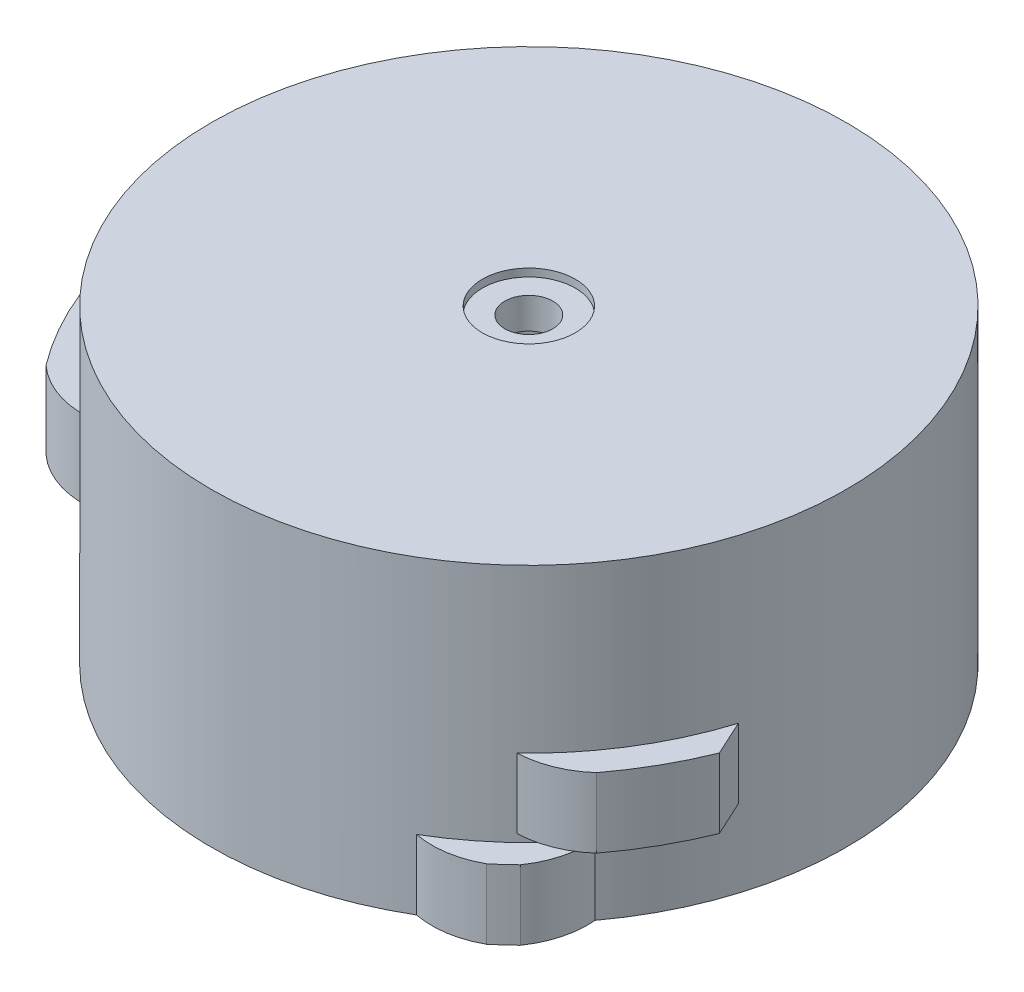
ISO-10303-21;
HEADER;
FILE_DESCRIPTION(('STEP AP214'),'2;1');
FILE_NAME('part.step','',(''),(''),'','','');
FILE_SCHEMA(('AUTOMOTIVE_DESIGN { 1 0 10303 214 1 1 1 1 }'));
ENDSEC;
DATA;
#1=APPLICATION_CONTEXT('core data for automotive mechanical design processes');
#2=APPLICATION_PROTOCOL_DEFINITION('international standard','automotive_design',2000,#1);
#3=PRODUCT_CONTEXT('',#1,'mechanical');
#4=PRODUCT('Part','Part','',(#3));
#5=PRODUCT_RELATED_PRODUCT_CATEGORY('part','',(#4));
#6=PRODUCT_DEFINITION_FORMATION('','',#4);
#7=PRODUCT_DEFINITION_CONTEXT('part definition',#1,'design');
#8=PRODUCT_DEFINITION('design','',#6,#7);
#9=PRODUCT_DEFINITION_SHAPE('','',#8);
#10=(LENGTH_UNIT() NAMED_UNIT(*) SI_UNIT(.MILLI.,.METRE.));
#11=(NAMED_UNIT(*) PLANE_ANGLE_UNIT() SI_UNIT($,.RADIAN.));
#12=(NAMED_UNIT(*) SI_UNIT($,.STERADIAN.) SOLID_ANGLE_UNIT());
#13=UNCERTAINTY_MEASURE_WITH_UNIT(LENGTH_MEASURE(1.E-05),#10,'distance_accuracy_value','');
#14=(GEOMETRIC_REPRESENTATION_CONTEXT(3) GLOBAL_UNCERTAINTY_ASSIGNED_CONTEXT((#13)) GLOBAL_UNIT_ASSIGNED_CONTEXT((#10,
#11,#12)) REPRESENTATION_CONTEXT('',''));
#15=CARTESIAN_POINT('',(0.,0.,0.));
#16=DIRECTION('',(0.,0.,1.));
#17=DIRECTION('',(1.,0.,0.));
#18=AXIS2_PLACEMENT_3D('',#15,#16,#17);
#19=CARTESIAN_POINT('',(0.,40.001,0.));
#20=DIRECTION('',(0.,-1.,0.));
#21=DIRECTION('',(0.,0.,-1.));
#22=AXIS2_PLACEMENT_3D('',#19,#20,#21);
#23=CYLINDRICAL_SURFACE('',#22,3.1);
#24=CARTESIAN_POINT('',(0.,35.,0.));
#25=DIRECTION('',(0.,-1.,0.));
#26=DIRECTION('',(0.,0.,-1.));
#27=AXIS2_PLACEMENT_3D('',#24,#25,#26);
#28=CIRCLE('',#27,3.1);
#29=CARTESIAN_POINT('',(0.,35.,-3.1));
#30=VERTEX_POINT('',#29);
#31=EDGE_CURVE('E190',#30,#30,#28,.T.);
#32=ORIENTED_EDGE('',*,*,#31,.T.);
#33=EDGE_LOOP('',(#32));
#34=FACE_BOUND('',#33,.T.);
#35=CARTESIAN_POINT('',(0.,39.,0.));
#36=DIRECTION('',(0.,1.,0.));
#37=DIRECTION('',(0.,0.,1.));
#38=AXIS2_PLACEMENT_3D('',#35,#36,#37);
#39=CIRCLE('',#38,3.1);
#40=CARTESIAN_POINT('',(0.,39.,3.1));
#41=VERTEX_POINT('',#40);
#42=EDGE_CURVE('E36',#41,#41,#39,.F.);
#43=ORIENTED_EDGE('',*,*,#42,.F.);
#44=EDGE_LOOP('',(#43));
#45=FACE_BOUND('',#44,.T.);
#46=ADVANCED_FACE('F32',(#34,#45),#23,.F.);
#47=CARTESIAN_POINT('',(0.,40.,0.));
#48=DIRECTION('',(0.,-1.,0.));
#49=DIRECTION('',(0.,0.,-1.));
#50=AXIS2_PLACEMENT_3D('',#47,#48,#49);
#51=CYLINDRICAL_SURFACE('',#50,41.);
#52=CARTESIAN_POINT('',(0.,19.,0.));
#53=DIRECTION('',(0.,-1.,0.));
#54=DIRECTION('',(0.,0.,1.));
#55=AXIS2_PLACEMENT_3D('',#52,#53,#54);
#56=CIRCLE('',#55,41.);
#57=CARTESIAN_POINT('',(39.1645223059696,19.,12.1301357183342));
#58=VERTEX_POINT('',#57);
#59=CARTESIAN_POINT('',(28.2276291042107,19.,29.7355167292435));
#60=VERTEX_POINT('',#59);
#61=EDGE_CURVE('E261',#58,#60,#56,.T.);
#62=ORIENTED_EDGE('',*,*,#61,.F.);
#63=DIRECTION('',(0.,-1.,0.));
#64=VECTOR('',#63,1.);
#65=CARTESIAN_POINT('',(39.1645223059696,19.,12.1301357183342));
#66=LINE('',#65,#64);
#67=CARTESIAN_POINT('',(39.1645223059696,10.,12.1301357183342));
#68=VERTEX_POINT('',#67);
#69=EDGE_CURVE('E279',#58,#68,#66,.T.);
#70=ORIENTED_EDGE('',*,*,#69,.T.);
#71=CARTESIAN_POINT('',(0.,10.,0.));
#72=DIRECTION('',(0.,-1.,0.));
#73=DIRECTION('',(0.,0.,1.));
#74=AXIS2_PLACEMENT_3D('',#71,#72,#73);
#75=CIRCLE('',#74,41.);
#76=CARTESIAN_POINT('',(28.2276291042107,10.,29.7355167292435));
#77=VERTEX_POINT('',#76);
#78=EDGE_CURVE('E270',#68,#77,#75,.T.);
#79=ORIENTED_EDGE('',*,*,#78,.T.);
#80=DIRECTION('',(0.,-1.,0.));
#81=VECTOR('',#80,1.);
#82=CARTESIAN_POINT('',(28.2276291042107,19.,29.7355167292435));
#83=LINE('',#82,#81);
#84=EDGE_CURVE('E276',#60,#77,#83,.T.);
#85=ORIENTED_EDGE('',*,*,#84,.F.);
#86=EDGE_LOOP('',(#62,#70,#79,#85));
#87=FACE_BOUND('',#86,.T.);
#88=CARTESIAN_POINT('',(0.,40.,0.));
#89=DIRECTION('',(0.,1.,0.));
#90=DIRECTION('',(0.,0.,1.));
#91=AXIS2_PLACEMENT_3D('',#88,#89,#90);
#92=CIRCLE('',#91,41.);
#93=CARTESIAN_POINT('',(0.,40.,41.));
#94=VERTEX_POINT('',#93);
#95=EDGE_CURVE('E11',#94,#94,#92,.T.);
#96=ORIENTED_EDGE('',*,*,#95,.F.);
#97=EDGE_LOOP('',(#96));
#98=FACE_BOUND('',#97,.T.);
#99=DIRECTION('',(0.,-1.,0.));
#100=VECTOR('',#99,1.);
#101=CARTESIAN_POINT('',(32.9539553214911,9.,24.3933767377371));
#102=LINE('',#101,#100);
#103=CARTESIAN_POINT('',(32.9539553214911,9.,24.393376737737));
#104=VERTEX_POINT('',#103);
#105=CARTESIAN_POINT('',(32.9539553214911,0.,24.3933767377371));
#106=VERTEX_POINT('',#105);
#107=EDGE_CURVE('E311',#104,#106,#102,.T.);
#108=ORIENTED_EDGE('',*,*,#107,.T.);
#109=CARTESIAN_POINT('',(0.,0.,0.));
#110=DIRECTION('',(0.,1.,0.));
#111=DIRECTION('',(0.,0.,1.));
#112=AXIS2_PLACEMENT_3D('',#109,#110,#111);
#113=CIRCLE('',#112,41.);
#114=CARTESIAN_POINT('',(20.8151209593003,0.,35.3232322905152));
#115=VERTEX_POINT('',#114);
#116=EDGE_CURVE('E41',#106,#115,#113,.T.);
#117=ORIENTED_EDGE('',*,*,#116,.T.);
#118=DIRECTION('',(0.,-1.,0.));
#119=VECTOR('',#118,1.);
#120=CARTESIAN_POINT('',(20.8151209593003,9.,35.3232322905152));
#121=LINE('',#120,#119);
#122=CARTESIAN_POINT('',(20.8151209593003,9.,35.3232322905152));
#123=VERTEX_POINT('',#122);
#124=EDGE_CURVE('E308',#123,#115,#121,.T.);
#125=ORIENTED_EDGE('',*,*,#124,.F.);
#126=CARTESIAN_POINT('',(0.,9.,0.));
#127=DIRECTION('',(0.,-1.,0.));
#128=DIRECTION('',(0.,0.,1.));
#129=AXIS2_PLACEMENT_3D('',#126,#127,#128);
#130=CIRCLE('',#129,41.);
#131=EDGE_CURVE('E289',#104,#123,#130,.T.);
#132=ORIENTED_EDGE('',*,*,#131,.F.);
#133=EDGE_LOOP('',(#108,#117,#125,#132));
#134=FACE_BOUND('',#133,.T.);
#135=CARTESIAN_POINT('',(0.,29.,0.));
#136=DIRECTION('',(0.,-1.,0.));
#137=DIRECTION('',(0.,0.,1.));
#138=AXIS2_PLACEMENT_3D('',#135,#136,#137);
#139=CIRCLE('',#138,41.);
#140=CARTESIAN_POINT('',(-28.087672454866,29.,29.8677527790117));
#141=VERTEX_POINT('',#140);
#142=CARTESIAN_POINT('',(-39.3040869869838,29.,11.669993407008));
#143=VERTEX_POINT('',#142);
#144=EDGE_CURVE('E231',#141,#143,#139,.T.);
#145=ORIENTED_EDGE('',*,*,#144,.F.);
#146=DIRECTION('',(0.,-1.,0.));
#147=VECTOR('',#146,1.);
#148=CARTESIAN_POINT('',(-28.087672454866,29.,29.8677527790117));
#149=LINE('',#148,#147);
#150=CARTESIAN_POINT('',(-28.087672454866,19.,29.8677527790117));
#151=VERTEX_POINT('',#150);
#152=EDGE_CURVE('E248',#141,#151,#149,.T.);
#153=ORIENTED_EDGE('',*,*,#152,.T.);
#154=CARTESIAN_POINT('',(0.,19.,0.));
#155=DIRECTION('',(0.,-1.,0.));
#156=DIRECTION('',(0.,0.,1.));
#157=AXIS2_PLACEMENT_3D('',#154,#155,#156);
#158=CIRCLE('',#157,41.);
#159=CARTESIAN_POINT('',(-39.3040869869838,19.,11.669993407008));
#160=VERTEX_POINT('',#159);
#161=EDGE_CURVE('E240',#151,#160,#158,.T.);
#162=ORIENTED_EDGE('',*,*,#161,.T.);
#163=DIRECTION('',(0.,-1.,0.));
#164=VECTOR('',#163,1.);
#165=CARTESIAN_POINT('',(-39.3040869869838,29.,11.669993407008));
#166=LINE('',#165,#164);
#167=EDGE_CURVE('E246',#143,#160,#166,.T.);
#168=ORIENTED_EDGE('',*,*,#167,.F.);
#169=EDGE_LOOP('',(#145,#153,#162,#168));
#170=FACE_BOUND('',#169,.T.);
#171=ADVANCED_FACE('F34',(#87,#98,#134,#170),#51,.T.);
#172=CARTESIAN_POINT('',(0.,40.,0.));
#173=DIRECTION('',(0.,1.,0.));
#174=DIRECTION('',(0.,0.,1.));
#175=AXIS2_PLACEMENT_3D('',#172,#173,#174);
#176=PLANE('',#175);
#177=CARTESIAN_POINT('',(0.,40.,0.));
#178=DIRECTION('',(0.,1.,0.));
#179=DIRECTION('',(0.,0.,1.));
#180=AXIS2_PLACEMENT_3D('',#177,#178,#179);
#181=CIRCLE('',#180,6.);
#182=CARTESIAN_POINT('',(0.,40.,6.));
#183=VERTEX_POINT('',#182);
#184=EDGE_CURVE('E620',#183,#183,#181,.T.);
#185=ORIENTED_EDGE('',*,*,#184,.F.);
#186=EDGE_LOOP('',(#185));
#187=FACE_BOUND('',#186,.T.);
#188=ORIENTED_EDGE('',*,*,#95,.T.);
#189=EDGE_LOOP('',(#188));
#190=FACE_BOUND('',#189,.T.);
#191=ADVANCED_FACE('F351',(#187,#190),#176,.T.);
#192=CARTESIAN_POINT('',(0.,0.,0.));
#193=DIRECTION('',(0.,1.,0.));
#194=DIRECTION('',(0.,0.,1.));
#195=AXIS2_PLACEMENT_3D('',#192,#193,#194);
#196=PLANE('',#195);
#197=CARTESIAN_POINT('',(0.,0.,0.));
#198=DIRECTION('',(0.,-1.,0.));
#199=DIRECTION('',(0.,0.,-1.));
#200=AXIS2_PLACEMENT_3D('',#197,#198,#199);
#201=CIRCLE('',#200,35.);
#202=CARTESIAN_POINT('',(0.,0.,-35.));
#203=VERTEX_POINT('',#202);
#204=EDGE_CURVE('E212',#203,#203,#201,.T.);
#205=ORIENTED_EDGE('',*,*,#204,.F.);
#206=EDGE_LOOP('',(#205));
#207=FACE_BOUND('',#206,.T.);
#208=ORIENTED_EDGE('',*,*,#116,.F.);
#209=CARTESIAN_POINT('',(21.4690229408635,0.,25.3972945249821));
#210=DIRECTION('',(0.,1.,0.));
#211=DIRECTION('',(0.,0.,1.));
#212=AXIS2_PLACEMENT_3D('',#209,#210,#211);
#213=CIRCLE('',#212,11.528725979532);
#214=CARTESIAN_POINT('',(30.9122974854254,0.,32.0106211150699));
#215=VERTEX_POINT('',#214);
#216=EDGE_CURVE('E285',#215,#106,#213,.T.);
#217=ORIENTED_EDGE('',*,*,#216,.F.);
#218=CARTESIAN_POINT('',(0.,0.,0.));
#219=DIRECTION('',(0.,1.,0.));
#220=DIRECTION('',(0.,0.,1.));
#221=AXIS2_PLACEMENT_3D('',#218,#219,#220);
#222=CIRCLE('',#221,44.5);
#223=CARTESIAN_POINT('',(28.604048631051,0.,34.0889777187945));
#224=VERTEX_POINT('',#223);
#225=EDGE_CURVE('E290',#224,#215,#222,.T.);
#226=ORIENTED_EDGE('',*,*,#225,.F.);
#227=CARTESIAN_POINT('',(23.014041512345,0.,24.0061535547048));
#228=DIRECTION('',(0.,1.,0.));
#229=DIRECTION('',(0.,0.,-1.));
#230=AXIS2_PLACEMENT_3D('',#227,#228,#229);
#231=CIRCLE('',#230,11.528725979532);
#232=EDGE_CURVE('E300',#115,#224,#231,.T.);
#233=ORIENTED_EDGE('',*,*,#232,.F.);
#234=EDGE_LOOP('',(#208,#217,#226,#233));
#235=FACE_BOUND('',#234,.T.);
#236=ADVANCED_FACE('F324',(#207,#235),#196,.F.);
#237=CARTESIAN_POINT('',(21.4690229408635,9.,25.3972945249821));
#238=DIRECTION('',(0.,-1.,0.));
#239=DIRECTION('',(0.,0.,-1.));
#240=AXIS2_PLACEMENT_3D('',#237,#238,#239);
#241=CYLINDRICAL_SURFACE('',#240,11.528725979532);
#242=ORIENTED_EDGE('',*,*,#216,.T.);
#243=ORIENTED_EDGE('',*,*,#107,.F.);
#244=CARTESIAN_POINT('',(21.4690229408635,9.,25.3972945249821));
#245=DIRECTION('',(0.,1.,0.));
#246=DIRECTION('',(0.,0.,1.));
#247=AXIS2_PLACEMENT_3D('',#244,#245,#246);
#248=CIRCLE('',#247,11.528725979532);
#249=CARTESIAN_POINT('',(30.9122974854254,9.,32.0106211150699));
#250=VERTEX_POINT('',#249);
#251=EDGE_CURVE('E286',#250,#104,#248,.T.);
#252=ORIENTED_EDGE('',*,*,#251,.F.);
#253=DIRECTION('',(0.,-1.,0.));
#254=VECTOR('',#253,1.);
#255=CARTESIAN_POINT('',(30.9122974854254,9.,32.0106211150699));
#256=LINE('',#255,#254);
#257=EDGE_CURVE('E297',#250,#215,#256,.T.);
#258=ORIENTED_EDGE('',*,*,#257,.T.);
#259=EDGE_LOOP('',(#242,#243,#252,#258));
#260=FACE_BOUND('',#259,.T.);
#261=ADVANCED_FACE('F331',(#260),#241,.T.);
#262=CARTESIAN_POINT('',(23.014041512345,9.,24.0061535547048));
#263=DIRECTION('',(0.,-1.,0.));
#264=DIRECTION('',(0.,0.,-1.));
#265=AXIS2_PLACEMENT_3D('',#262,#263,#264);
#266=CYLINDRICAL_SURFACE('',#265,11.528725979532);
#267=ORIENTED_EDGE('',*,*,#232,.T.);
#268=DIRECTION('',(0.,-1.,0.));
#269=VECTOR('',#268,1.);
#270=CARTESIAN_POINT('',(28.604048631051,9.,34.0889777187945));
#271=LINE('',#270,#269);
#272=CARTESIAN_POINT('',(28.604048631051,9.,34.0889777187945));
#273=VERTEX_POINT('',#272);
#274=EDGE_CURVE('E305',#273,#224,#271,.T.);
#275=ORIENTED_EDGE('',*,*,#274,.F.);
#276=CARTESIAN_POINT('',(23.014041512345,9.,24.0061535547048));
#277=DIRECTION('',(0.,1.,0.));
#278=DIRECTION('',(0.,0.,-1.));
#279=AXIS2_PLACEMENT_3D('',#276,#277,#278);
#280=CIRCLE('',#279,11.528725979532);
#281=EDGE_CURVE('E293',#123,#273,#280,.T.);
#282=ORIENTED_EDGE('',*,*,#281,.F.);
#283=ORIENTED_EDGE('',*,*,#124,.T.);
#284=EDGE_LOOP('',(#267,#275,#282,#283));
#285=FACE_BOUND('',#284,.T.);
#286=ADVANCED_FACE('F321',(#285),#266,.T.);
#287=CARTESIAN_POINT('',(0.,9.,0.));
#288=DIRECTION('',(0.,-1.,0.));
#289=DIRECTION('',(0.,0.,-1.));
#290=AXIS2_PLACEMENT_3D('',#287,#288,#289);
#291=CYLINDRICAL_SURFACE('',#290,44.5);
#292=ORIENTED_EDGE('',*,*,#225,.T.);
#293=ORIENTED_EDGE('',*,*,#257,.F.);
#294=CARTESIAN_POINT('',(0.,9.,0.));
#295=DIRECTION('',(0.,1.,0.));
#296=DIRECTION('',(0.,0.,1.));
#297=AXIS2_PLACEMENT_3D('',#294,#295,#296);
#298=CIRCLE('',#297,44.5);
#299=EDGE_CURVE('E295',#273,#250,#298,.T.);
#300=ORIENTED_EDGE('',*,*,#299,.F.);
#301=ORIENTED_EDGE('',*,*,#274,.T.);
#302=EDGE_LOOP('',(#292,#293,#300,#301));
#303=FACE_BOUND('',#302,.T.);
#304=ADVANCED_FACE('F327',(#303),#291,.T.);
#305=CARTESIAN_POINT('',(10.7345114704317,9.,12.698647262491));
#306=DIRECTION('',(0.,1.,0.));
#307=DIRECTION('',(0.,0.,1.));
#308=AXIS2_PLACEMENT_3D('',#305,#306,#307);
#309=PLANE('',#308);
#310=ORIENTED_EDGE('',*,*,#251,.T.);
#311=ORIENTED_EDGE('',*,*,#131,.T.);
#312=ORIENTED_EDGE('',*,*,#281,.T.);
#313=ORIENTED_EDGE('',*,*,#299,.T.);
#314=EDGE_LOOP('',(#310,#311,#312,#313));
#315=FACE_BOUND('',#314,.T.);
#316=ADVANCED_FACE('F333',(#315),#309,.T.);
#317=CARTESIAN_POINT('',(0.,19.,0.));
#318=DIRECTION('',(0.,-1.,0.));
#319=DIRECTION('',(0.,0.,-1.));
#320=AXIS2_PLACEMENT_3D('',#317,#318,#319);
#321=CYLINDRICAL_SURFACE('',#320,44.5);
#322=CARTESIAN_POINT('',(0.,10.,0.));
#323=DIRECTION('',(0.,1.,0.));
#324=DIRECTION('',(0.,0.,-1.));
#325=AXIS2_PLACEMENT_3D('',#322,#323,#324);
#326=CIRCLE('',#325,44.5);
#327=CARTESIAN_POINT('',(35.5392801971046,10.,26.7807685302661));
#328=VERTEX_POINT('',#327);
#329=CARTESIAN_POINT('',(41.2596815282221,10.,16.669993407008));
#330=VERTEX_POINT('',#329);
#331=EDGE_CURVE('E254',#328,#330,#326,.T.);
#332=ORIENTED_EDGE('',*,*,#331,.T.);
#333=DIRECTION('',(0.,-1.,0.));
#334=VECTOR('',#333,1.);
#335=CARTESIAN_POINT('',(41.2596815282221,19.,16.669993407008));
#336=LINE('',#335,#334);
#337=CARTESIAN_POINT('',(41.2596815282221,19.,16.669993407008));
#338=VERTEX_POINT('',#337);
#339=EDGE_CURVE('E282',#338,#330,#336,.T.);
#340=ORIENTED_EDGE('',*,*,#339,.F.);
#341=CARTESIAN_POINT('',(0.,19.,0.));
#342=DIRECTION('',(0.,1.,0.));
#343=DIRECTION('',(0.,0.,-1.));
#344=AXIS2_PLACEMENT_3D('',#341,#342,#343);
#345=CIRCLE('',#344,44.5);
#346=CARTESIAN_POINT('',(35.5392801971046,19.,26.7807685302661));
#347=VERTEX_POINT('',#346);
#348=EDGE_CURVE('E255',#347,#338,#345,.T.);
#349=ORIENTED_EDGE('',*,*,#348,.F.);
#350=DIRECTION('',(0.,-1.,0.));
#351=VECTOR('',#350,1.);
#352=CARTESIAN_POINT('',(35.5392801971046,19.,26.7807685302661));
#353=LINE('',#352,#351);
#354=EDGE_CURVE('E265',#347,#328,#353,.T.);
#355=ORIENTED_EDGE('',*,*,#354,.T.);
#356=EDGE_LOOP('',(#332,#340,#349,#355));
#357=FACE_BOUND('',#356,.T.);
#358=ADVANCED_FACE('F335',(#357),#321,.T.);
#359=CARTESIAN_POINT('',(41.2596815282221,19.,16.669993407008));
#360=DIRECTION('',(-0.907971537734758,0.,0.41903184445049));
#361=DIRECTION('',(0.41903184445049,0.,0.907971537734758));
#362=AXIS2_PLACEMENT_3D('',#359,#360,#361);
#363=PLANE('',#362);
#364=DIRECTION('',(-0.41903184445049,0.,-0.907971537734758));
#365=VECTOR('',#364,1.);
#366=CARTESIAN_POINT('',(41.2596815282221,10.,16.669993407008));
#367=LINE('',#366,#365);
#368=EDGE_CURVE('E268',#330,#68,#367,.T.);
#369=ORIENTED_EDGE('',*,*,#368,.T.);
#370=ORIENTED_EDGE('',*,*,#69,.F.);
#371=DIRECTION('',(-0.41903184445049,0.,-0.907971537734758));
#372=VECTOR('',#371,1.);
#373=CARTESIAN_POINT('',(41.2596815282221,19.,16.669993407008));
#374=LINE('',#373,#372);
#375=EDGE_CURVE('E258',#338,#58,#374,.T.);
#376=ORIENTED_EDGE('',*,*,#375,.F.);
#377=ORIENTED_EDGE('',*,*,#339,.T.);
#378=EDGE_LOOP('',(#369,#370,#376,#377));
#379=FACE_BOUND('',#378,.T.);
#380=ADVANCED_FACE('F341',(#379),#363,.F.);
#381=CARTESIAN_POINT('',(27.8244026722253,19.,18.2138444914265));
#382=DIRECTION('',(0.,-1.,0.));
#383=DIRECTION('',(0.,0.,-1.));
#384=AXIS2_PLACEMENT_3D('',#381,#382,#383);
#385=CYLINDRICAL_SURFACE('',#384,11.5287259795319);
#386=CARTESIAN_POINT('',(27.8244026722253,10.,18.2138444914265));
#387=DIRECTION('',(0.,1.,0.));
#388=DIRECTION('',(0.,0.,-1.));
#389=AXIS2_PLACEMENT_3D('',#386,#387,#388);
#390=CIRCLE('',#389,11.5287259795319);
#391=EDGE_CURVE('E259',#77,#328,#390,.T.);
#392=ORIENTED_EDGE('',*,*,#391,.T.);
#393=ORIENTED_EDGE('',*,*,#354,.F.);
#394=CARTESIAN_POINT('',(27.8244026722253,19.,18.2138444914265));
#395=DIRECTION('',(0.,1.,0.));
#396=DIRECTION('',(0.,0.,-1.));
#397=AXIS2_PLACEMENT_3D('',#394,#395,#396);
#398=CIRCLE('',#397,11.5287259795319);
#399=EDGE_CURVE('E263',#60,#347,#398,.T.);
#400=ORIENTED_EDGE('',*,*,#399,.F.);
#401=ORIENTED_EDGE('',*,*,#84,.T.);
#402=EDGE_LOOP('',(#392,#393,#400,#401));
#403=FACE_BOUND('',#402,.T.);
#404=ADVANCED_FACE('F413',(#403),#385,.T.);
#405=CARTESIAN_POINT('',(0.,19.,0.));
#406=DIRECTION('',(0.,-1.,0.));
#407=DIRECTION('',(0.,0.,-1.));
#408=AXIS2_PLACEMENT_3D('',#405,#406,#407);
#409=PLANE('',#408);
#410=ORIENTED_EDGE('',*,*,#348,.T.);
#411=ORIENTED_EDGE('',*,*,#375,.T.);
#412=ORIENTED_EDGE('',*,*,#61,.T.);
#413=ORIENTED_EDGE('',*,*,#399,.T.);
#414=EDGE_LOOP('',(#410,#411,#412,#413));
#415=FACE_BOUND('',#414,.T.);
#416=ADVANCED_FACE('F410',(#415),#409,.F.);
#417=CARTESIAN_POINT('',(0.,10.,0.));
#418=DIRECTION('',(0.,-1.,0.));
#419=DIRECTION('',(0.,0.,-1.));
#420=AXIS2_PLACEMENT_3D('',#417,#418,#419);
#421=PLANE('',#420);
#422=ORIENTED_EDGE('',*,*,#331,.F.);
#423=ORIENTED_EDGE('',*,*,#391,.F.);
#424=ORIENTED_EDGE('',*,*,#78,.F.);
#425=ORIENTED_EDGE('',*,*,#368,.F.);
#426=EDGE_LOOP('',(#422,#423,#424,#425));
#427=FACE_BOUND('',#426,.T.);
#428=ADVANCED_FACE('F408',(#427),#421,.T.);
#429=CARTESIAN_POINT('',(0.,29.,0.));
#430=DIRECTION('',(0.,-1.,0.));
#431=DIRECTION('',(0.,0.,-1.));
#432=AXIS2_PLACEMENT_3D('',#429,#430,#431);
#433=CYLINDRICAL_SURFACE('',#432,44.5);
#434=CARTESIAN_POINT('',(0.,19.,0.));
#435=DIRECTION('',(0.,1.,0.));
#436=DIRECTION('',(0.,0.,-1.));
#437=AXIS2_PLACEMENT_3D('',#434,#435,#436);
#438=CIRCLE('',#437,44.5);
#439=CARTESIAN_POINT('',(-41.2596815282221,19.,16.669993407008));
#440=VERTEX_POINT('',#439);
#441=CARTESIAN_POINT('',(-35.5392801971046,19.,26.7807685302661));
#442=VERTEX_POINT('',#441);
#443=EDGE_CURVE('E223',#440,#442,#438,.T.);
#444=ORIENTED_EDGE('',*,*,#443,.T.);
#445=DIRECTION('',(0.,-1.,0.));
#446=VECTOR('',#445,1.);
#447=CARTESIAN_POINT('',(-35.5392801971046,29.,26.7807685302661));
#448=LINE('',#447,#446);
#449=CARTESIAN_POINT('',(-35.5392801971046,29.,26.7807685302661));
#450=VERTEX_POINT('',#449);
#451=EDGE_CURVE('E251',#450,#442,#448,.T.);
#452=ORIENTED_EDGE('',*,*,#451,.F.);
#453=CARTESIAN_POINT('',(0.,29.,0.));
#454=DIRECTION('',(0.,1.,0.));
#455=DIRECTION('',(0.,0.,-1.));
#456=AXIS2_PLACEMENT_3D('',#453,#454,#455);
#457=CIRCLE('',#456,44.5);
#458=CARTESIAN_POINT('',(-41.2596815282221,29.,16.669993407008));
#459=VERTEX_POINT('',#458);
#460=EDGE_CURVE('E226',#459,#450,#457,.T.);
#461=ORIENTED_EDGE('',*,*,#460,.F.);
#462=DIRECTION('',(0.,-1.,0.));
#463=VECTOR('',#462,1.);
#464=CARTESIAN_POINT('',(-41.2596815282221,29.,16.669993407008));
#465=LINE('',#464,#463);
#466=EDGE_CURVE('E235',#459,#440,#465,.T.);
#467=ORIENTED_EDGE('',*,*,#466,.T.);
#468=EDGE_LOOP('',(#444,#452,#461,#467));
#469=FACE_BOUND('',#468,.T.);
#470=ADVANCED_FACE('F404',(#469),#433,.T.);
#471=CARTESIAN_POINT('',(-27.5727665671649,29.,18.087698649422));
#472=DIRECTION('',(0.,-1.,0.));
#473=DIRECTION('',(0.,0.,-1.));
#474=AXIS2_PLACEMENT_3D('',#471,#472,#473);
#475=CYLINDRICAL_SURFACE('',#474,11.7913020217978);
#476=CARTESIAN_POINT('',(-27.5727665671649,19.,18.087698649422));
#477=DIRECTION('',(0.,1.,0.));
#478=DIRECTION('',(0.,0.,1.));
#479=AXIS2_PLACEMENT_3D('',#476,#477,#478);
#480=CIRCLE('',#479,11.7913020217978);
#481=EDGE_CURVE('E238',#442,#151,#480,.T.);
#482=ORIENTED_EDGE('',*,*,#481,.T.);
#483=ORIENTED_EDGE('',*,*,#152,.F.);
#484=CARTESIAN_POINT('',(-27.5727665671649,29.,18.087698649422));
#485=DIRECTION('',(0.,1.,0.));
#486=DIRECTION('',(0.,0.,1.));
#487=AXIS2_PLACEMENT_3D('',#484,#485,#486);
#488=CIRCLE('',#487,11.7913020217978);
#489=EDGE_CURVE('E229',#450,#141,#488,.T.);
#490=ORIENTED_EDGE('',*,*,#489,.F.);
#491=ORIENTED_EDGE('',*,*,#451,.T.);
#492=EDGE_LOOP('',(#482,#483,#490,#491));
#493=FACE_BOUND('',#492,.T.);
#494=ADVANCED_FACE('F400',(#493),#475,.T.);
#495=CARTESIAN_POINT('',(-41.2596815282221,29.,16.669993407008));
#496=DIRECTION('',(0.93130137246203,0.,0.36424957604689));
#497=DIRECTION('',(0.36424957604689,0.,-0.93130137246203));
#498=AXIS2_PLACEMENT_3D('',#495,#496,#497);
#499=PLANE('',#498);
#500=DIRECTION('',(-0.36424957604689,0.,0.93130137246203));
#501=VECTOR('',#500,1.);
#502=CARTESIAN_POINT('',(-41.2596815282221,19.,16.669993407008));
#503=LINE('',#502,#501);
#504=EDGE_CURVE('E57',#160,#440,#503,.T.);
#505=ORIENTED_EDGE('',*,*,#504,.T.);
#506=ORIENTED_EDGE('',*,*,#466,.F.);
#507=DIRECTION('',(-0.36424957604689,0.,0.93130137246203));
#508=VECTOR('',#507,1.);
#509=CARTESIAN_POINT('',(-41.2596815282221,29.,16.669993407008));
#510=LINE('',#509,#508);
#511=EDGE_CURVE('E233',#143,#459,#510,.T.);
#512=ORIENTED_EDGE('',*,*,#511,.F.);
#513=ORIENTED_EDGE('',*,*,#167,.T.);
#514=EDGE_LOOP('',(#505,#506,#512,#513));
#515=FACE_BOUND('',#514,.T.);
#516=ADVANCED_FACE('F394',(#515),#499,.F.);
#517=CARTESIAN_POINT('',(0.,29.,0.));
#518=DIRECTION('',(0.,-1.,0.));
#519=DIRECTION('',(0.,0.,-1.));
#520=AXIS2_PLACEMENT_3D('',#517,#518,#519);
#521=PLANE('',#520);
#522=ORIENTED_EDGE('',*,*,#460,.T.);
#523=ORIENTED_EDGE('',*,*,#489,.T.);
#524=ORIENTED_EDGE('',*,*,#144,.T.);
#525=ORIENTED_EDGE('',*,*,#511,.T.);
#526=EDGE_LOOP('',(#522,#523,#524,#525));
#527=FACE_BOUND('',#526,.T.);
#528=ADVANCED_FACE('F391',(#527),#521,.F.);
#529=CARTESIAN_POINT('',(0.,19.,0.));
#530=DIRECTION('',(0.,-1.,0.));
#531=DIRECTION('',(0.,0.,-1.));
#532=AXIS2_PLACEMENT_3D('',#529,#530,#531);
#533=PLANE('',#532);
#534=ORIENTED_EDGE('',*,*,#443,.F.);
#535=ORIENTED_EDGE('',*,*,#504,.F.);
#536=ORIENTED_EDGE('',*,*,#161,.F.);
#537=ORIENTED_EDGE('',*,*,#481,.F.);
#538=EDGE_LOOP('',(#534,#535,#536,#537));
#539=FACE_BOUND('',#538,.T.);
#540=ADVANCED_FACE('F389',(#539),#533,.T.);
#541=CARTESIAN_POINT('',(0.,10.,0.));
#542=DIRECTION('',(0.,-1.,0.));
#543=DIRECTION('',(0.,0.,-1.));
#544=AXIS2_PLACEMENT_3D('',#541,#542,#543);
#545=CYLINDRICAL_SURFACE('',#544,35.);
#546=CARTESIAN_POINT('',(0.,10.,0.));
#547=DIRECTION('',(0.,-1.,0.));
#548=DIRECTION('',(0.,0.,-1.));
#549=AXIS2_PLACEMENT_3D('',#546,#547,#548);
#550=CIRCLE('',#549,35.);
#551=CARTESIAN_POINT('',(0.,10.,-35.));
#552=VERTEX_POINT('',#551);
#553=EDGE_CURVE('E220',#552,#552,#550,.T.);
#554=ORIENTED_EDGE('',*,*,#553,.F.);
#555=EDGE_LOOP('',(#554));
#556=FACE_BOUND('',#555,.T.);
#557=ORIENTED_EDGE('',*,*,#204,.T.);
#558=EDGE_LOOP('',(#557));
#559=FACE_BOUND('',#558,.T.);
#560=ADVANCED_FACE('F385',(#556,#559),#545,.F.);
#561=CARTESIAN_POINT('',(0.,10.,0.));
#562=DIRECTION('',(0.,-1.,0.));
#563=DIRECTION('',(0.,0.,-1.));
#564=AXIS2_PLACEMENT_3D('',#561,#562,#563);
#565=PLANE('',#564);
#566=CARTESIAN_POINT('',(2.5,10.,-8.75961897684236));
#567=DIRECTION('',(0.,1.,0.));
#568=DIRECTION('',(0.,0.,1.));
#569=AXIS2_PLACEMENT_3D('',#566,#567,#568);
#570=CIRCLE('',#569,0.500000000000001);
#571=CARTESIAN_POINT('',(2.5,10.,-8.25961897684236));
#572=VERTEX_POINT('',#571);
#573=CARTESIAN_POINT('',(3.,10.,-8.75961897684236));
#574=VERTEX_POINT('',#573);
#575=EDGE_CURVE('E167',#572,#574,#570,.T.);
#576=ORIENTED_EDGE('',*,*,#575,.F.);
#577=DIRECTION('',(1.,0.,0.));
#578=VECTOR('',#577,1.);
#579=CARTESIAN_POINT('',(-2.5,10.,-8.25961897684236));
#580=LINE('',#579,#578);
#581=CARTESIAN_POINT('',(-2.5,10.,-8.25961897684236));
#582=VERTEX_POINT('',#581);
#583=EDGE_CURVE('E185',#582,#572,#580,.T.);
#584=ORIENTED_EDGE('',*,*,#583,.F.);
#585=CARTESIAN_POINT('',(-2.5,10.,-8.75961897684236));
#586=DIRECTION('',(0.,1.,0.));
#587=DIRECTION('',(0.,0.,-1.));
#588=AXIS2_PLACEMENT_3D('',#585,#586,#587);
#589=CIRCLE('',#588,0.500000000000001);
#590=CARTESIAN_POINT('',(-3.,10.,-8.75961897684236));
#591=VERTEX_POINT('',#590);
#592=EDGE_CURVE('E49',#591,#582,#589,.T.);
#593=ORIENTED_EDGE('',*,*,#592,.F.);
#594=DIRECTION('',(0.,0.,1.));
#595=VECTOR('',#594,1.);
#596=CARTESIAN_POINT('',(-3.,10.,-8.75961897684236));
#597=LINE('',#596,#595);
#598=CARTESIAN_POINT('',(-3.,10.,-10.8426242211007));
#599=VERTEX_POINT('',#598);
#600=EDGE_CURVE('E206',#599,#591,#597,.T.);
#601=ORIENTED_EDGE('',*,*,#600,.F.);
#602=CARTESIAN_POINT('',(0.,10.,0.));
#603=DIRECTION('',(0.,-1.,0.));
#604=DIRECTION('',(0.,0.,-1.));
#605=AXIS2_PLACEMENT_3D('',#602,#603,#604);
#606=CIRCLE('',#605,11.25);
#607=CARTESIAN_POINT('',(3.,10.,-10.8426242211007));
#608=VERTEX_POINT('',#607);
#609=EDGE_CURVE('E203',#608,#599,#606,.T.);
#610=ORIENTED_EDGE('',*,*,#609,.F.);
#611=DIRECTION('',(0.,0.,-1.));
#612=VECTOR('',#611,1.);
#613=CARTESIAN_POINT('',(3.,10.,-8.75961897684236));
#614=LINE('',#613,#612);
#615=EDGE_CURVE('E201',#574,#608,#614,.T.);
#616=ORIENTED_EDGE('',*,*,#615,.F.);
#617=EDGE_LOOP('',(#576,#584,#593,#601,#610,#616));
#618=FACE_BOUND('',#617,.T.);
#619=ORIENTED_EDGE('',*,*,#553,.T.);
#620=EDGE_LOOP('',(#619));
#621=FACE_BOUND('',#620,.T.);
#622=ADVANCED_FACE('F382',(#618,#621),#565,.T.);
#623=CARTESIAN_POINT('',(2.5,35.,-8.75961897684236));
#624=DIRECTION('',(0.,-1.,0.));
#625=DIRECTION('',(0.,0.,-1.));
#626=AXIS2_PLACEMENT_3D('',#623,#624,#625);
#627=CYLINDRICAL_SURFACE('',#626,0.500000000000001);
#628=ORIENTED_EDGE('',*,*,#575,.T.);
#629=DIRECTION('',(0.,-1.,0.));
#630=VECTOR('',#629,1.);
#631=CARTESIAN_POINT('',(3.,35.,-8.75961897684236));
#632=LINE('',#631,#630);
#633=CARTESIAN_POINT('',(3.,35.,-8.75961897684236));
#634=VERTEX_POINT('',#633);
#635=EDGE_CURVE('E160',#634,#574,#632,.T.);
#636=ORIENTED_EDGE('',*,*,#635,.F.);
#637=CARTESIAN_POINT('',(2.5,35.,-8.75961897684236));
#638=DIRECTION('',(0.,1.,0.));
#639=DIRECTION('',(0.,0.,1.));
#640=AXIS2_PLACEMENT_3D('',#637,#638,#639);
#641=CIRCLE('',#640,0.500000000000001);
#642=CARTESIAN_POINT('',(2.5,35.,-8.25961897684236));
#643=VERTEX_POINT('',#642);
#644=EDGE_CURVE('E164',#643,#634,#641,.T.);
#645=ORIENTED_EDGE('',*,*,#644,.F.);
#646=DIRECTION('',(0.,-1.,0.));
#647=VECTOR('',#646,1.);
#648=CARTESIAN_POINT('',(2.5,35.,-8.25961897684236));
#649=LINE('',#648,#647);
#650=EDGE_CURVE('E210',#643,#572,#649,.T.);
#651=ORIENTED_EDGE('',*,*,#650,.T.);
#652=EDGE_LOOP('',(#628,#636,#645,#651));
#653=FACE_BOUND('',#652,.T.);
#654=ADVANCED_FACE('F162',(#653),#627,.T.);
#655=CARTESIAN_POINT('',(-2.5,35.,-8.25961897684236));
#656=DIRECTION('',(0.,0.,-1.));
#657=DIRECTION('',(-1.,0.,0.));
#658=AXIS2_PLACEMENT_3D('',#655,#656,#657);
#659=PLANE('',#658);
#660=ORIENTED_EDGE('',*,*,#583,.T.);
#661=ORIENTED_EDGE('',*,*,#650,.F.);
#662=DIRECTION('',(1.,0.,0.));
#663=VECTOR('',#662,1.);
#664=CARTESIAN_POINT('',(-2.5,35.,-8.25961897684236));
#665=LINE('',#664,#663);
#666=CARTESIAN_POINT('',(-2.5,35.,-8.25961897684236));
#667=VERTEX_POINT('',#666);
#668=EDGE_CURVE('E172',#667,#643,#665,.T.);
#669=ORIENTED_EDGE('',*,*,#668,.F.);
#670=DIRECTION('',(0.,-1.,0.));
#671=VECTOR('',#670,1.);
#672=CARTESIAN_POINT('',(-2.5,35.,-8.25961897684236));
#673=LINE('',#672,#671);
#674=EDGE_CURVE('E213',#667,#582,#673,.T.);
#675=ORIENTED_EDGE('',*,*,#674,.T.);
#676=EDGE_LOOP('',(#660,#661,#669,#675));
#677=FACE_BOUND('',#676,.T.);
#678=ADVANCED_FACE('F363',(#677),#659,.F.);
#679=CARTESIAN_POINT('',(-2.5,35.,-8.75961897684236));
#680=DIRECTION('',(0.,-1.,0.));
#681=DIRECTION('',(0.,0.,-1.));
#682=AXIS2_PLACEMENT_3D('',#679,#680,#681);
#683=CYLINDRICAL_SURFACE('',#682,0.500000000000001);
#684=ORIENTED_EDGE('',*,*,#592,.T.);
#685=ORIENTED_EDGE('',*,*,#674,.F.);
#686=CARTESIAN_POINT('',(-2.5,35.,-8.75961897684236));
#687=DIRECTION('',(0.,1.,0.));
#688=DIRECTION('',(0.,0.,-1.));
#689=AXIS2_PLACEMENT_3D('',#686,#687,#688);
#690=CIRCLE('',#689,0.500000000000001);
#691=CARTESIAN_POINT('',(-3.,35.,-8.75961897684236));
#692=VERTEX_POINT('',#691);
#693=EDGE_CURVE('E197',#692,#667,#690,.T.);
#694=ORIENTED_EDGE('',*,*,#693,.F.);
#695=DIRECTION('',(0.,-1.,0.));
#696=VECTOR('',#695,1.);
#697=CARTESIAN_POINT('',(-3.,35.,-8.75961897684236));
#698=LINE('',#697,#696);
#699=EDGE_CURVE('E215',#692,#591,#698,.T.);
#700=ORIENTED_EDGE('',*,*,#699,.T.);
#701=EDGE_LOOP('',(#684,#685,#694,#700));
#702=FACE_BOUND('',#701,.T.);
#703=ADVANCED_FACE('F366',(#702),#683,.T.);
#704=CARTESIAN_POINT('',(-3.,35.,-8.75961897684236));
#705=DIRECTION('',(1.,0.,0.));
#706=DIRECTION('',(0.,0.,-1.));
#707=AXIS2_PLACEMENT_3D('',#704,#705,#706);
#708=PLANE('',#707);
#709=ORIENTED_EDGE('',*,*,#600,.T.);
#710=ORIENTED_EDGE('',*,*,#699,.F.);
#711=DIRECTION('',(0.,0.,1.));
#712=VECTOR('',#711,1.);
#713=CARTESIAN_POINT('',(-3.,35.,-8.75961897684236));
#714=LINE('',#713,#712);
#715=CARTESIAN_POINT('',(-3.,35.,-10.8426242211007));
#716=VERTEX_POINT('',#715);
#717=EDGE_CURVE('E194',#716,#692,#714,.T.);
#718=ORIENTED_EDGE('',*,*,#717,.F.);
#719=DIRECTION('',(0.,-1.,0.));
#720=VECTOR('',#719,1.);
#721=CARTESIAN_POINT('',(-3.,35.,-10.8426242211007));
#722=LINE('',#721,#720);
#723=EDGE_CURVE('E217',#716,#599,#722,.T.);
#724=ORIENTED_EDGE('',*,*,#723,.T.);
#725=EDGE_LOOP('',(#709,#710,#718,#724));
#726=FACE_BOUND('',#725,.T.);
#727=ADVANCED_FACE('F370',(#726),#708,.F.);
#728=CARTESIAN_POINT('',(0.,35.,0.));
#729=DIRECTION('',(0.,-1.,0.));
#730=DIRECTION('',(0.,0.,-1.));
#731=AXIS2_PLACEMENT_3D('',#728,#729,#730);
#732=CYLINDRICAL_SURFACE('',#731,11.25);
#733=ORIENTED_EDGE('',*,*,#609,.T.);
#734=ORIENTED_EDGE('',*,*,#723,.F.);
#735=CARTESIAN_POINT('',(0.,35.,0.));
#736=DIRECTION('',(0.,-1.,0.));
#737=DIRECTION('',(0.,0.,-1.));
#738=AXIS2_PLACEMENT_3D('',#735,#736,#737);
#739=CIRCLE('',#738,11.25);
#740=CARTESIAN_POINT('',(3.,35.,-10.8426242211007));
#741=VERTEX_POINT('',#740);
#742=EDGE_CURVE('E180',#741,#716,#739,.T.);
#743=ORIENTED_EDGE('',*,*,#742,.F.);
#744=DIRECTION('',(0.,-1.,0.));
#745=VECTOR('',#744,1.);
#746=CARTESIAN_POINT('',(3.,35.,-10.8426242211007));
#747=LINE('',#746,#745);
#748=EDGE_CURVE('E171',#741,#608,#747,.T.);
#749=ORIENTED_EDGE('',*,*,#748,.T.);
#750=EDGE_LOOP('',(#733,#734,#743,#749));
#751=FACE_BOUND('',#750,.T.);
#752=ADVANCED_FACE('F373',(#751),#732,.F.);
#753=CARTESIAN_POINT('',(3.,35.,-8.75961897684236));
#754=DIRECTION('',(-1.,0.,0.));
#755=DIRECTION('',(0.,0.,1.));
#756=AXIS2_PLACEMENT_3D('',#753,#754,#755);
#757=PLANE('',#756);
#758=ORIENTED_EDGE('',*,*,#615,.T.);
#759=ORIENTED_EDGE('',*,*,#748,.F.);
#760=DIRECTION('',(0.,0.,-1.));
#761=VECTOR('',#760,1.);
#762=CARTESIAN_POINT('',(3.,35.,-8.75961897684236));
#763=LINE('',#762,#761);
#764=EDGE_CURVE('E175',#634,#741,#763,.T.);
#765=ORIENTED_EDGE('',*,*,#764,.F.);
#766=ORIENTED_EDGE('',*,*,#635,.T.);
#767=EDGE_LOOP('',(#758,#759,#765,#766));
#768=FACE_BOUND('',#767,.T.);
#769=ADVANCED_FACE('F176',(#768),#757,.F.);
#770=CARTESIAN_POINT('',(2.5,35.,-8.75961897684236));
#771=DIRECTION('',(0.,1.,0.));
#772=DIRECTION('',(0.,0.,1.));
#773=AXIS2_PLACEMENT_3D('',#770,#771,#772);
#774=PLANE('',#773);
#775=ORIENTED_EDGE('',*,*,#31,.F.);
#776=EDGE_LOOP('',(#775));
#777=FACE_BOUND('',#776,.T.);
#778=ORIENTED_EDGE('',*,*,#644,.T.);
#779=ORIENTED_EDGE('',*,*,#764,.T.);
#780=ORIENTED_EDGE('',*,*,#742,.T.);
#781=ORIENTED_EDGE('',*,*,#717,.T.);
#782=ORIENTED_EDGE('',*,*,#693,.T.);
#783=ORIENTED_EDGE('',*,*,#668,.T.);
#784=EDGE_LOOP('',(#778,#779,#780,#781,#782,#783));
#785=FACE_BOUND('',#784,.T.);
#786=ADVANCED_FACE('F182',(#777,#785),#774,.F.);
#787=CARTESIAN_POINT('',(0.,39.,0.));
#788=DIRECTION('',(0.,1.,0.));
#789=DIRECTION('',(0.,0.,1.));
#790=AXIS2_PLACEMENT_3D('',#787,#788,#789);
#791=PLANE('',#790);
#792=CARTESIAN_POINT('',(0.,39.,0.));
#793=DIRECTION('',(0.,1.,0.));
#794=DIRECTION('',(0.,0.,1.));
#795=AXIS2_PLACEMENT_3D('',#792,#793,#794);
#796=CIRCLE('',#795,6.);
#797=CARTESIAN_POINT('',(0.,39.,6.));
#798=VERTEX_POINT('',#797);
#799=EDGE_CURVE('E618',#798,#798,#796,.T.);
#800=ORIENTED_EDGE('',*,*,#799,.T.);
#801=EDGE_LOOP('',(#800));
#802=FACE_BOUND('',#801,.T.);
#803=ORIENTED_EDGE('',*,*,#42,.T.);
#804=EDGE_LOOP('',(#803));
#805=FACE_BOUND('',#804,.T.);
#806=ADVANCED_FACE('F361',(#802,#805),#791,.T.);
#807=CARTESIAN_POINT('',(0.,39.,0.));
#808=DIRECTION('',(0.,1.,0.));
#809=DIRECTION('',(0.,0.,1.));
#810=AXIS2_PLACEMENT_3D('',#807,#808,#809);
#811=CYLINDRICAL_SURFACE('',#810,6.);
#812=ORIENTED_EDGE('',*,*,#799,.F.);
#813=EDGE_LOOP('',(#812));
#814=FACE_BOUND('',#813,.T.);
#815=ORIENTED_EDGE('',*,*,#184,.T.);
#816=EDGE_LOOP('',(#815));
#817=FACE_BOUND('',#816,.T.);
#818=ADVANCED_FACE('F357',(#814,#817),#811,.F.);
#819=CLOSED_SHELL('',(#46,#171,#191,#236,#261,#286,#304,#316,#358,#380,#404,#416,#428,#470,#494,
#516,#528,#540,#560,#622,#654,#678,#703,#727,#752,#769,#786,#806,#818));
#820=MANIFOLD_SOLID_BREP('B2',#819);
#821=ADVANCED_BREP_SHAPE_REPRESENTATION('',(#18,#820),#14);
#822=SHAPE_DEFINITION_REPRESENTATION(#9,#821);
ENDSEC;
END-ISO-10303-21;
